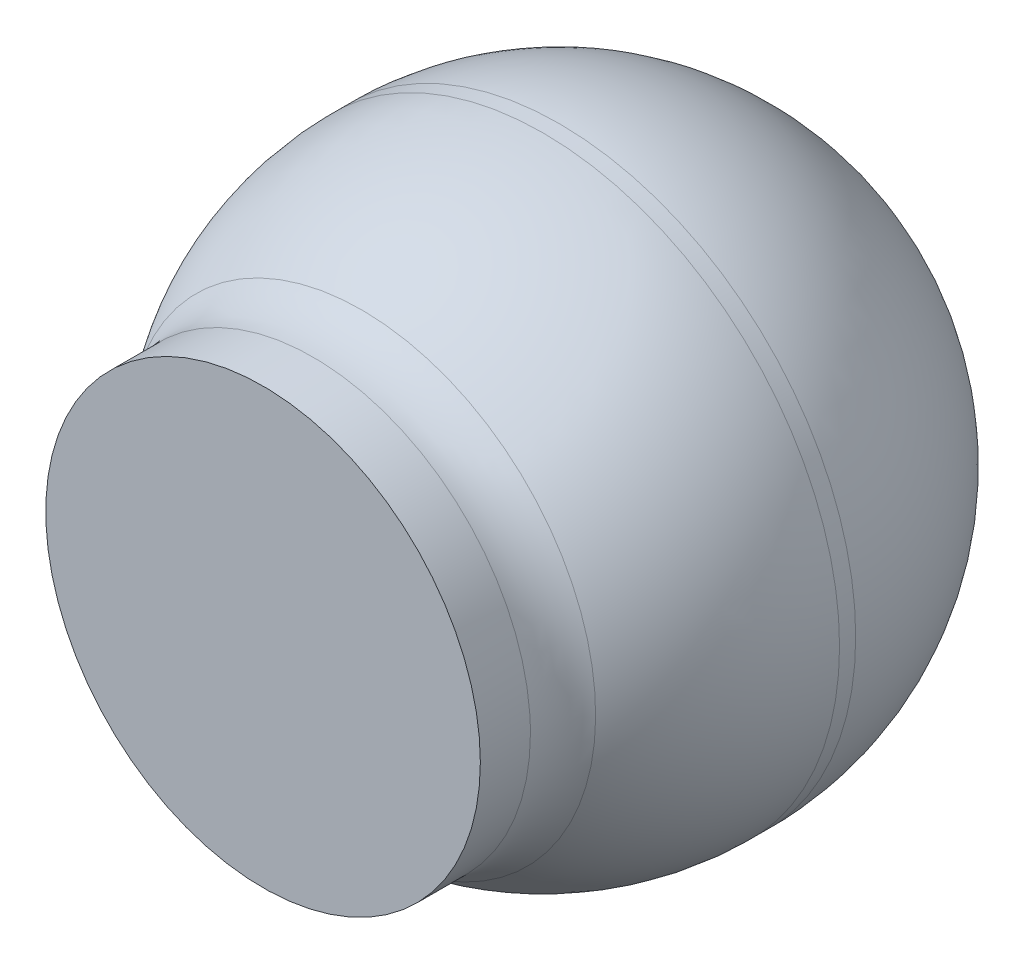
ISO-10303-21;
HEADER;
FILE_DESCRIPTION(('STEP AP214'),'2;1');
FILE_NAME('part.step','',(''),(''),'','','');
FILE_SCHEMA(('AUTOMOTIVE_DESIGN { 1 0 10303 214 1 1 1 1 }'));
ENDSEC;
DATA;
#1=APPLICATION_CONTEXT('core data for automotive mechanical design processes');
#2=APPLICATION_PROTOCOL_DEFINITION('international standard','automotive_design',2000,#1);
#3=PRODUCT_CONTEXT('',#1,'mechanical');
#4=PRODUCT('Part','Part','',(#3));
#5=PRODUCT_RELATED_PRODUCT_CATEGORY('part','',(#4));
#6=PRODUCT_DEFINITION_FORMATION('','',#4);
#7=PRODUCT_DEFINITION_CONTEXT('part definition',#1,'design');
#8=PRODUCT_DEFINITION('design','',#6,#7);
#9=PRODUCT_DEFINITION_SHAPE('','',#8);
#10=(LENGTH_UNIT() NAMED_UNIT(*) SI_UNIT(.MILLI.,.METRE.));
#11=(NAMED_UNIT(*) PLANE_ANGLE_UNIT() SI_UNIT($,.RADIAN.));
#12=(NAMED_UNIT(*) SI_UNIT($,.STERADIAN.) SOLID_ANGLE_UNIT());
#13=UNCERTAINTY_MEASURE_WITH_UNIT(LENGTH_MEASURE(1.E-05),#10,'distance_accuracy_value','');
#14=(GEOMETRIC_REPRESENTATION_CONTEXT(3) GLOBAL_UNCERTAINTY_ASSIGNED_CONTEXT((#13)) GLOBAL_UNIT_ASSIGNED_CONTEXT((#10,
#11,#12)) REPRESENTATION_CONTEXT('',''));
#15=CARTESIAN_POINT('',(0.,0.,0.));
#16=DIRECTION('',(0.,0.,1.));
#17=DIRECTION('',(1.,0.,0.));
#18=AXIS2_PLACEMENT_3D('',#15,#16,#17);
#19=CARTESIAN_POINT('',(0.707080077731,-9.131349291452,10.006534503384));
#20=DIRECTION('',(0.,0.,-1.));
#21=DIRECTION('',(-1.,0.,0.));
#22=AXIS2_PLACEMENT_3D('',#19,#20,#21);
#23=PLANE('',#22);
#24=CARTESIAN_POINT('',(0.707080077731,-9.131349291452,10.006534503384));
#25=DIRECTION('',(0.,0.,1.));
#26=DIRECTION('',(1.,0.,0.));
#27=AXIS2_PLACEMENT_3D('',#24,#25,#26);
#28=CIRCLE('',#27,0.275);
#29=CARTESIAN_POINT('',(0.982080077731,-9.131349291452,10.006534503384));
#30=VERTEX_POINT('',#29);
#31=EDGE_CURVE('E20',#30,#30,#28,.F.);
#32=ORIENTED_EDGE('',*,*,#31,.F.);
#33=EDGE_LOOP('',(#32));
#34=FACE_BOUND('',#33,.T.);
#35=ADVANCED_FACE('F17',(#34),#23,.F.);
#36=CARTESIAN_POINT('',(0.707080077731,-9.131349291452,9.906534503384));
#37=DIRECTION('',(0.,0.,1.));
#38=DIRECTION('',(1.,0.,0.));
#39=AXIS2_PLACEMENT_3D('',#36,#37,#38);
#40=CYLINDRICAL_SURFACE('',#39,0.275);
#41=CARTESIAN_POINT('',(0.707080077731,-9.131349291452,9.943180457728));
#42=DIRECTION('',(0.,0.,-1.));
#43=DIRECTION('',(0.996700902337582,0.081162252799247,0.));
#44=AXIS2_PLACEMENT_3D('',#41,#42,#43);
#45=CIRCLE('',#44,0.275);
#46=CARTESIAN_POINT('',(0.981172825873835,-9.10902967193221,9.943180457728));
#47=VERTEX_POINT('',#46);
#48=EDGE_CURVE('E65',#47,#47,#45,.F.);
#49=ORIENTED_EDGE('',*,*,#48,.T.);
#50=EDGE_LOOP('',(#49));
#51=FACE_BOUND('',#50,.T.);
#52=ORIENTED_EDGE('',*,*,#31,.T.);
#53=EDGE_LOOP('',(#52));
#54=FACE_BOUND('',#53,.T.);
#55=ADVANCED_FACE('F62',(#51,#54),#40,.T.);
#56=CARTESIAN_POINT('',(0.707080077731,-9.131349291452,9.943180457728));
#57=DIRECTION('',(0.,0.,-1.));
#58=DIRECTION('',(0.996700902337583,0.0811622527992449,0.));
#59=AXIS2_PLACEMENT_3D('',#56,#57,#58);
#60=TOROIDAL_SURFACE('',#59,0.375,0.1);
#61=ORIENTED_EDGE('',*,*,#48,.F.);
#62=EDGE_LOOP('',(#61));
#63=FACE_BOUND('',#62,.T.);
#64=CARTESIAN_POINT('',(0.707080077731001,-9.131349291452,9.881744931236));
#65=DIRECTION('',(0.,0.,-1.));
#66=DIRECTION('',(-0.996700902337598,-0.0811622527990622,0.));
#67=AXIS2_PLACEMENT_3D('',#64,#65,#66);
#68=CIRCLE('',#67,0.296097046412665);
#69=CARTESIAN_POINT('',(0.411959884392,-9.155381194786,9.881744931236));
#70=VERTEX_POINT('',#69);
#71=EDGE_CURVE('E39',#70,#70,#68,.T.);
#72=ORIENTED_EDGE('',*,*,#71,.F.);
#73=EDGE_LOOP('',(#72));
#74=FACE_BOUND('',#73,.T.);
#75=ADVANCED_FACE('F57',(#63,#74),#60,.F.);
#76=CARTESIAN_POINT('',(0.333317239355,-9.161785136252,9.651976062157));
#77=CARTESIAN_POINT('',(0.333317239355,-9.161785136252,9.701461392103));
#78=CARTESIAN_POINT('',(0.341473782652,-9.161120941579,9.750947004335));
#79=CARTESIAN_POINT('',(0.357792914651,-9.159792059952,9.798626332798));
#80=CARTESIAN_POINT('',(0.381658609162,-9.157848654938,9.842699544317));
#81=CARTESIAN_POINT('',(0.411959884392,-9.155381194786,9.881744931236));
#82=(BOUNDED_CURVE() B_SPLINE_CURVE(5,(#76,#77,#78,#79,#80,#81),.UNSPECIFIED.,.F.,
.F.) B_SPLINE_CURVE_WITH_KNOTS((6,6),(0.,0.661568582165),
.UNSPECIFIED.) CURVE() GEOMETRIC_REPRESENTATION_ITEM() RATIONAL_B_SPLINE_CURVE((1.,1.,1.,1.,1.,1.)) REPRESENTATION_ITEM(''));
#83=CARTESIAN_POINT('',(0.707080077731,-9.131349291452,9.651976062157));
#84=DIRECTION('',(0.,0.,-1.));
#85=AXIS1_PLACEMENT('',#83,#84);
#86=SURFACE_OF_REVOLUTION('',#82,#85);
#87=CARTESIAN_POINT('',(0.707080077731001,-9.131349291452,9.651976062157));
#88=DIRECTION('',(0.,0.,1.));
#89=DIRECTION('',(1.,0.,0.));
#90=AXIS2_PLACEMENT_3D('',#87,#88,#89);
#91=CIRCLE('',#90,0.375);
#92=CARTESIAN_POINT('',(1.082080077731,-9.131349291452,9.651976062157));
#93=VERTEX_POINT('',#92);
#94=EDGE_CURVE('E36',#93,#93,#91,.F.);
#95=ORIENTED_EDGE('',*,*,#94,.F.);
#96=EDGE_LOOP('',(#95));
#97=FACE_BOUND('',#96,.T.);
#98=ORIENTED_EDGE('',*,*,#71,.T.);
#99=EDGE_LOOP('',(#98));
#100=FACE_BOUND('',#99,.T.);
#101=ADVANCED_FACE('F53',(#97,#100),#86,.F.);
#102=CARTESIAN_POINT('',(0.707080077731,-9.131349291452,9.256534503384));
#103=DIRECTION('',(0.,0.,1.));
#104=DIRECTION('',(1.,0.,0.));
#105=AXIS2_PLACEMENT_3D('',#102,#103,#104);
#106=CYLINDRICAL_SURFACE('',#105,0.375);
#107=CARTESIAN_POINT('',(0.707080077731,-9.131349291452,9.631534503384));
#108=DIRECTION('',(0.,0.,-1.));
#109=DIRECTION('',(0.0811622527992362,-0.996700902337583,0.));
#110=AXIS2_PLACEMENT_3D('',#107,#108,#109);
#111=CIRCLE('',#110,0.375);
#112=CARTESIAN_POINT('',(0.737515922530713,-9.50511212982859,9.631534503384));
#113=VERTEX_POINT('',#112);
#114=CARTESIAN_POINT('',(0.676644232931287,-8.75758645307541,9.631534503384));
#115=VERTEX_POINT('',#114);
#116=EDGE_CURVE('E11',#113,#115,#111,.T.);
#117=ORIENTED_EDGE('',*,*,#116,.F.);
#118=CARTESIAN_POINT('',(0.707080077731,-9.131349291452,9.631534503384));
#119=DIRECTION('',(0.,0.,1.));
#120=DIRECTION('',(0.0811622527992359,-0.996700902337583,0.));
#121=AXIS2_PLACEMENT_3D('',#118,#119,#120);
#122=CIRCLE('',#121,0.375);
#123=EDGE_CURVE('E25',#115,#113,#122,.F.);
#124=ORIENTED_EDGE('',*,*,#123,.F.);
#125=EDGE_LOOP('',(#117,#124));
#126=FACE_BOUND('',#125,.T.);
#127=ORIENTED_EDGE('',*,*,#94,.T.);
#128=EDGE_LOOP('',(#127));
#129=FACE_BOUND('',#128,.T.);
#130=ADVANCED_FACE('F34',(#126,#129),#106,.T.);
#131=CARTESIAN_POINT('',(0.707080077731,-9.131349291452,9.631534503384));
#132=DIRECTION('',(0.0811622527992361,-0.996700902337583,0.));
#133=DIRECTION('',(-0.996700902337583,-0.0811622527992361,0.));
#134=AXIS2_PLACEMENT_3D('',#131,#132,#133);
#135=SPHERICAL_SURFACE('',#134,0.375);
#136=ORIENTED_EDGE('',*,*,#123,.T.);
#137=ORIENTED_EDGE('',*,*,#116,.T.);
#138=EDGE_LOOP('',(#136,#137));
#139=FACE_BOUND('',#138,.T.);
#140=ADVANCED_FACE('F32',(#139),#135,.T.);
#141=CLOSED_SHELL('',(#35,#55,#75,#101,#130,#140));
#142=MANIFOLD_SOLID_BREP('B1',#141);
#143=ADVANCED_BREP_SHAPE_REPRESENTATION('',(#18,#142),#14);
#144=SHAPE_DEFINITION_REPRESENTATION(#9,#143);
ENDSEC;
END-ISO-10303-21;
